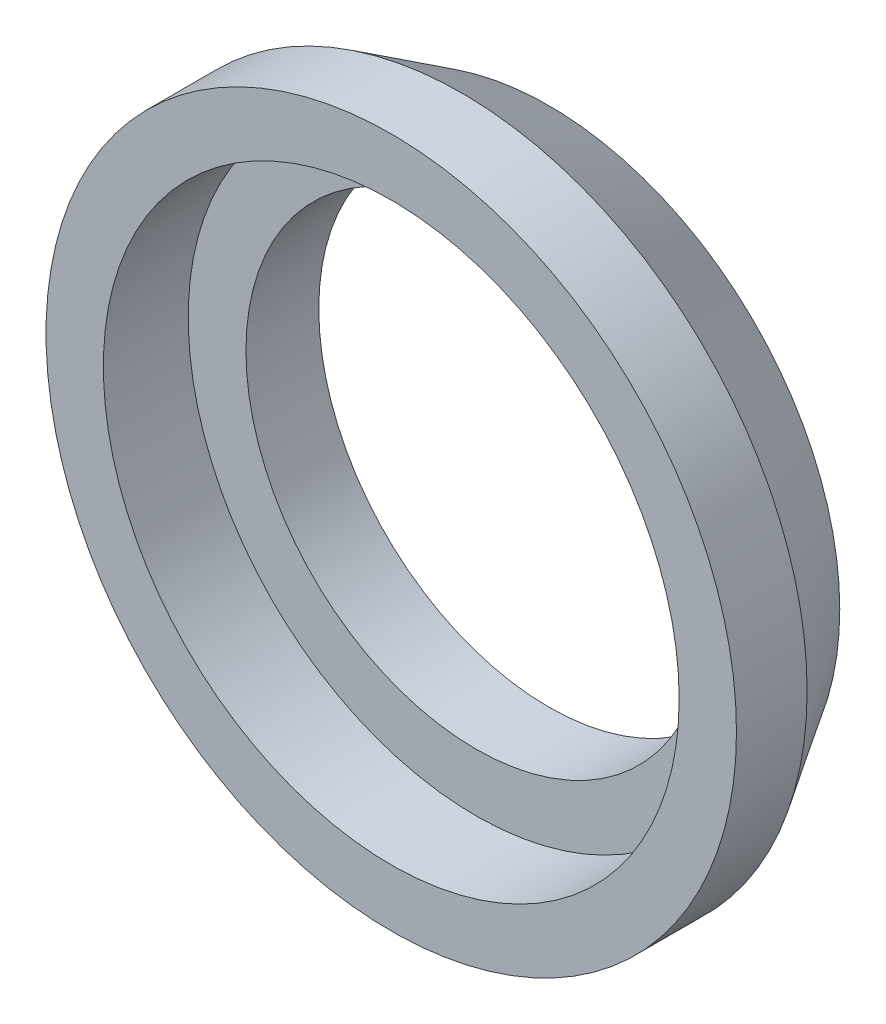
ISO-10303-21;
HEADER;
FILE_DESCRIPTION(('STEP AP214'),'2;1');
FILE_NAME('part.step','',(''),(''),'','','');
FILE_SCHEMA(('AUTOMOTIVE_DESIGN { 1 0 10303 214 1 1 1 1 }'));
ENDSEC;
DATA;
#1=APPLICATION_CONTEXT('core data for automotive mechanical design processes');
#2=APPLICATION_PROTOCOL_DEFINITION('international standard','automotive_design',2000,#1);
#3=PRODUCT_CONTEXT('',#1,'mechanical');
#4=PRODUCT('Part','Part','',(#3));
#5=PRODUCT_RELATED_PRODUCT_CATEGORY('part','',(#4));
#6=PRODUCT_DEFINITION_FORMATION('','',#4);
#7=PRODUCT_DEFINITION_CONTEXT('part definition',#1,'design');
#8=PRODUCT_DEFINITION('design','',#6,#7);
#9=PRODUCT_DEFINITION_SHAPE('','',#8);
#10=(LENGTH_UNIT() NAMED_UNIT(*) SI_UNIT(.MILLI.,.METRE.));
#11=(NAMED_UNIT(*) PLANE_ANGLE_UNIT() SI_UNIT($,.RADIAN.));
#12=(NAMED_UNIT(*) SI_UNIT($,.STERADIAN.) SOLID_ANGLE_UNIT());
#13=UNCERTAINTY_MEASURE_WITH_UNIT(LENGTH_MEASURE(1.E-05),#10,'distance_accuracy_value','');
#14=(GEOMETRIC_REPRESENTATION_CONTEXT(3) GLOBAL_UNCERTAINTY_ASSIGNED_CONTEXT((#13)) GLOBAL_UNIT_ASSIGNED_CONTEXT((#10,
#11,#12)) REPRESENTATION_CONTEXT('',''));
#15=CARTESIAN_POINT('',(0.,0.,0.));
#16=DIRECTION('',(0.,0.,1.));
#17=DIRECTION('',(1.,0.,0.));
#18=AXIS2_PLACEMENT_3D('',#15,#16,#17);
#19=CARTESIAN_POINT('',(0.,0.,4.5));
#20=DIRECTION('',(0.,0.,-1.));
#21=DIRECTION('',(-1.,0.,0.));
#22=AXIS2_PLACEMENT_3D('',#19,#20,#21);
#23=CYLINDRICAL_SURFACE('',#22,9.525);
#24=CARTESIAN_POINT('',(0.,0.,-2.09949820643843));
#25=DIRECTION('',(0.,0.,1.));
#26=DIRECTION('',(1.,0.,0.));
#27=AXIS2_PLACEMENT_3D('',#24,#25,#26);
#28=CIRCLE('',#27,9.525);
#29=CARTESIAN_POINT('',(9.525,0.,-2.09949820643843));
#30=VERTEX_POINT('',#29);
#31=EDGE_CURVE('E60',#30,#30,#28,.T.);
#32=ORIENTED_EDGE('',*,*,#31,.T.);
#33=EDGE_LOOP('',(#32));
#34=FACE_BOUND('',#33,.T.);
#35=CARTESIAN_POINT('',(0.,0.,-0.15));
#36=DIRECTION('',(0.,0.,1.));
#37=DIRECTION('',(1.,0.,0.));
#38=AXIS2_PLACEMENT_3D('',#35,#36,#37);
#39=CIRCLE('',#38,9.525);
#40=CARTESIAN_POINT('',(9.525,0.,-0.15));
#41=VERTEX_POINT('',#40);
#42=EDGE_CURVE('E80',#41,#41,#39,.T.);
#43=ORIENTED_EDGE('',*,*,#42,.F.);
#44=EDGE_LOOP('',(#43));
#45=FACE_BOUND('',#44,.T.);
#46=ADVANCED_FACE('F51',(#34,#45),#23,.T.);
#47=CARTESIAN_POINT('',(0.,0.,-2.491));
#48=DIRECTION('',(0.,0.,1.));
#49=DIRECTION('',(1.,0.,0.));
#50=AXIS2_PLACEMENT_3D('',#47,#48,#49);
#51=CYLINDRICAL_SURFACE('',#50,7.94385);
#52=CARTESIAN_POINT('',(0.,0.,-2.491));
#53=DIRECTION('',(0.,0.,1.));
#54=DIRECTION('',(1.,0.,0.));
#55=AXIS2_PLACEMENT_3D('',#52,#53,#54);
#56=CIRCLE('',#55,7.94385);
#57=CARTESIAN_POINT('',(7.94385,0.,-2.491));
#58=VERTEX_POINT('',#57);
#59=EDGE_CURVE('E74',#58,#58,#56,.T.);
#60=ORIENTED_EDGE('',*,*,#59,.F.);
#61=EDGE_LOOP('',(#60));
#62=FACE_BOUND('',#61,.T.);
#63=CARTESIAN_POINT('',(0.,0.,-0.15));
#64=DIRECTION('',(0.,0.,1.));
#65=DIRECTION('',(1.,0.,0.));
#66=AXIS2_PLACEMENT_3D('',#63,#64,#65);
#67=CIRCLE('',#66,7.94385);
#68=CARTESIAN_POINT('',(7.94385,0.,-0.15));
#69=VERTEX_POINT('',#68);
#70=EDGE_CURVE('E55',#69,#69,#67,.F.);
#71=ORIENTED_EDGE('',*,*,#70,.F.);
#72=EDGE_LOOP('',(#71));
#73=FACE_BOUND('',#72,.T.);
#74=ADVANCED_FACE('F94',(#62,#73),#51,.F.);
#75=CARTESIAN_POINT('',(0.,0.,-4.5));
#76=DIRECTION('',(0.,0.,1.));
#77=DIRECTION('',(1.,0.,0.));
#78=AXIS2_PLACEMENT_3D('',#75,#76,#77);
#79=CYLINDRICAL_SURFACE('',#78,6.35);
#80=CARTESIAN_POINT('',(0.,0.,-4.5));
#81=DIRECTION('',(0.,0.,1.));
#82=DIRECTION('',(1.,0.,0.));
#83=AXIS2_PLACEMENT_3D('',#80,#81,#82);
#84=CIRCLE('',#83,6.35);
#85=CARTESIAN_POINT('',(6.35,0.,-4.5));
#86=VERTEX_POINT('',#85);
#87=EDGE_CURVE('E68',#86,#86,#84,.T.);
#88=ORIENTED_EDGE('',*,*,#87,.F.);
#89=EDGE_LOOP('',(#88));
#90=FACE_BOUND('',#89,.T.);
#91=CARTESIAN_POINT('',(0.,0.,-2.491));
#92=DIRECTION('',(0.,0.,1.));
#93=DIRECTION('',(1.,0.,0.));
#94=AXIS2_PLACEMENT_3D('',#91,#92,#93);
#95=CIRCLE('',#94,6.35);
#96=CARTESIAN_POINT('',(6.35,0.,-2.491));
#97=VERTEX_POINT('',#96);
#98=EDGE_CURVE('E71',#97,#97,#95,.F.);
#99=ORIENTED_EDGE('',*,*,#98,.F.);
#100=EDGE_LOOP('',(#99));
#101=FACE_BOUND('',#100,.T.);
#102=ADVANCED_FACE('F96',(#90,#101),#79,.F.);
#103=CARTESIAN_POINT('',(0.,0.,-4.5));
#104=DIRECTION('',(0.,0.,1.));
#105=DIRECTION('',(1.,0.,0.));
#106=AXIS2_PLACEMENT_3D('',#103,#104,#105);
#107=PLANE('',#106);
#108=CARTESIAN_POINT('',(0.,0.,-4.5));
#109=DIRECTION('',(0.,0.,1.));
#110=DIRECTION('',(1.,0.,0.));
#111=AXIS2_PLACEMENT_3D('',#108,#109,#110);
#112=CIRCLE('',#111,8.025);
#113=CARTESIAN_POINT('',(8.025,0.,-4.5));
#114=VERTEX_POINT('',#113);
#115=EDGE_CURVE('E12',#114,#114,#112,.F.);
#116=ORIENTED_EDGE('',*,*,#115,.T.);
#117=EDGE_LOOP('',(#116));
#118=FACE_BOUND('',#117,.T.);
#119=ORIENTED_EDGE('',*,*,#87,.T.);
#120=EDGE_LOOP('',(#119));
#121=FACE_BOUND('',#120,.T.);
#122=ADVANCED_FACE('F103',(#118,#121),#107,.F.);
#123=CARTESIAN_POINT('',(0.,0.,-2.09949820643843));
#124=DIRECTION('',(0.,0.,1.));
#125=DIRECTION('',(1.,0.,0.));
#126=AXIS2_PLACEMENT_3D('',#123,#124,#125);
#127=CONICAL_SURFACE('',#126,9.525,0.558505360638187);
#128=ORIENTED_EDGE('',*,*,#115,.F.);
#129=EDGE_LOOP('',(#128));
#130=FACE_BOUND('',#129,.T.);
#131=ORIENTED_EDGE('',*,*,#31,.F.);
#132=EDGE_LOOP('',(#131));
#133=FACE_BOUND('',#132,.T.);
#134=ADVANCED_FACE('F53',(#130,#133),#127,.T.);
#135=CARTESIAN_POINT('',(0.,0.,-2.491));
#136=DIRECTION('',(0.,0.,1.));
#137=DIRECTION('',(1.,0.,0.));
#138=AXIS2_PLACEMENT_3D('',#135,#136,#137);
#139=PLANE('',#138);
#140=ORIENTED_EDGE('',*,*,#59,.T.);
#141=EDGE_LOOP('',(#140));
#142=FACE_BOUND('',#141,.T.);
#143=ORIENTED_EDGE('',*,*,#98,.T.);
#144=EDGE_LOOP('',(#143));
#145=FACE_BOUND('',#144,.T.);
#146=ADVANCED_FACE('F108',(#142,#145),#139,.T.);
#147=CARTESIAN_POINT('',(0.,0.,-0.15));
#148=DIRECTION('',(0.,0.,1.));
#149=DIRECTION('',(1.,0.,0.));
#150=AXIS2_PLACEMENT_3D('',#147,#148,#149);
#151=PLANE('',#150);
#152=ORIENTED_EDGE('',*,*,#70,.T.);
#153=EDGE_LOOP('',(#152));
#154=FACE_BOUND('',#153,.T.);
#155=ORIENTED_EDGE('',*,*,#42,.T.);
#156=EDGE_LOOP('',(#155));
#157=FACE_BOUND('',#156,.T.);
#158=ADVANCED_FACE('F92',(#154,#157),#151,.T.);
#159=CLOSED_SHELL('',(#46,#74,#102,#122,#134,#146,#158));
#160=MANIFOLD_SOLID_BREP('B2',#159);
#161=ADVANCED_BREP_SHAPE_REPRESENTATION('',(#18,#160),#14);
#162=SHAPE_DEFINITION_REPRESENTATION(#9,#161);
ENDSEC;
END-ISO-10303-21;
